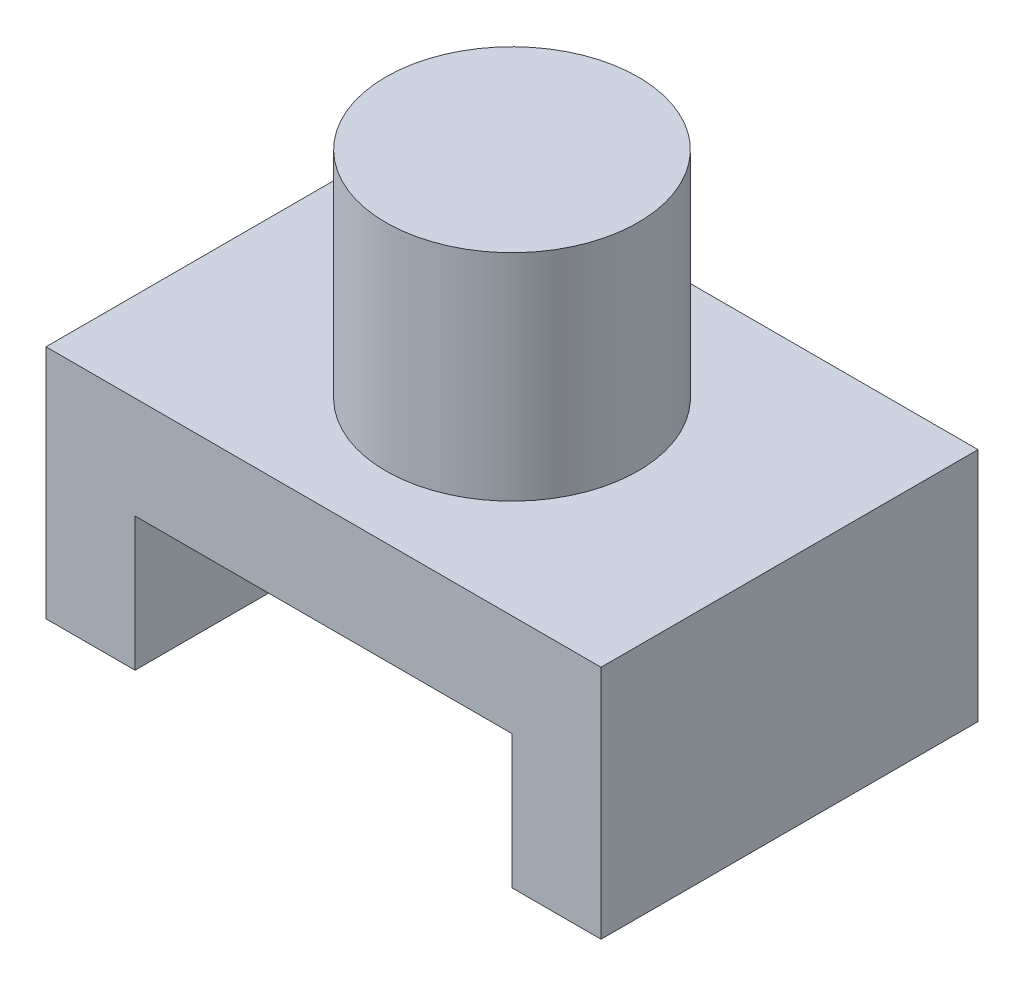
ISO-10303-21;
HEADER;
FILE_DESCRIPTION(('STEP AP214'),'2;1');
FILE_NAME('part.step','',(''),(''),'','','');
FILE_SCHEMA(('AUTOMOTIVE_DESIGN { 1 0 10303 214 1 1 1 1 }'));
ENDSEC;
DATA;
#1=APPLICATION_CONTEXT('core data for automotive mechanical design processes');
#2=APPLICATION_PROTOCOL_DEFINITION('international standard','automotive_design',2000,#1);
#3=PRODUCT_CONTEXT('',#1,'mechanical');
#4=PRODUCT('Part','Part','',(#3));
#5=PRODUCT_RELATED_PRODUCT_CATEGORY('part','',(#4));
#6=PRODUCT_DEFINITION_FORMATION('','',#4);
#7=PRODUCT_DEFINITION_CONTEXT('part definition',#1,'design');
#8=PRODUCT_DEFINITION('design','',#6,#7);
#9=PRODUCT_DEFINITION_SHAPE('','',#8);
#10=(LENGTH_UNIT() NAMED_UNIT(*) SI_UNIT(.MILLI.,.METRE.));
#11=(NAMED_UNIT(*) PLANE_ANGLE_UNIT() SI_UNIT($,.RADIAN.));
#12=(NAMED_UNIT(*) SI_UNIT($,.STERADIAN.) SOLID_ANGLE_UNIT());
#13=UNCERTAINTY_MEASURE_WITH_UNIT(LENGTH_MEASURE(1.E-05),#10,'distance_accuracy_value','');
#14=(GEOMETRIC_REPRESENTATION_CONTEXT(3) GLOBAL_UNCERTAINTY_ASSIGNED_CONTEXT((#13)) GLOBAL_UNIT_ASSIGNED_CONTEXT((#10,
#11,#12)) REPRESENTATION_CONTEXT('',''));
#15=CARTESIAN_POINT('',(0.,0.,0.));
#16=DIRECTION('',(0.,0.,1.));
#17=DIRECTION('',(1.,0.,0.));
#18=AXIS2_PLACEMENT_3D('',#15,#16,#17);
#19=CARTESIAN_POINT('',(-16.1895348837209,0.,25.4));
#20=DIRECTION('',(0.,1.,0.));
#21=DIRECTION('',(0.,0.,1.));
#22=AXIS2_PLACEMENT_3D('',#19,#20,#21);
#23=PLANE('',#22);
#24=DIRECTION('',(1.,0.,0.));
#25=VECTOR('',#24,1.);
#26=CARTESIAN_POINT('',(-16.1895348837209,0.,0.));
#27=LINE('',#26,#25);
#28=CARTESIAN_POINT('',(-16.1895348837209,0.,0.));
#29=VERTEX_POINT('',#28);
#30=CARTESIAN_POINT('',(-10.1895348837209,0.,0.));
#31=VERTEX_POINT('',#30);
#32=EDGE_CURVE('E142',#29,#31,#27,.T.);
#33=ORIENTED_EDGE('',*,*,#32,.T.);
#34=DIRECTION('',(0.,0.,-1.));
#35=VECTOR('',#34,1.);
#36=CARTESIAN_POINT('',(-10.1895348837209,0.,25.4));
#37=LINE('',#36,#35);
#38=CARTESIAN_POINT('',(-10.1895348837209,0.,25.4));
#39=VERTEX_POINT('',#38);
#40=EDGE_CURVE('E42',#39,#31,#37,.T.);
#41=ORIENTED_EDGE('',*,*,#40,.F.);
#42=DIRECTION('',(1.,0.,0.));
#43=VECTOR('',#42,1.);
#44=CARTESIAN_POINT('',(-16.1895348837209,0.,25.4));
#45=LINE('',#44,#43);
#46=CARTESIAN_POINT('',(-16.1895348837209,0.,25.4));
#47=VERTEX_POINT('',#46);
#48=EDGE_CURVE('E165',#47,#39,#45,.T.);
#49=ORIENTED_EDGE('',*,*,#48,.F.);
#50=DIRECTION('',(0.,0.,-1.));
#51=VECTOR('',#50,1.);
#52=CARTESIAN_POINT('',(-16.1895348837209,0.,25.4));
#53=LINE('',#52,#51);
#54=EDGE_CURVE('E138',#47,#29,#53,.T.);
#55=ORIENTED_EDGE('',*,*,#54,.T.);
#56=EDGE_LOOP('',(#33,#41,#49,#55));
#57=FACE_BOUND('',#56,.T.);
#58=ADVANCED_FACE('F39',(#57),#23,.F.);
#59=CARTESIAN_POINT('',(-10.1895348837209,0.,25.4));
#60=DIRECTION('',(-1.,0.,0.));
#61=DIRECTION('',(0.,0.,1.));
#62=AXIS2_PLACEMENT_3D('',#59,#60,#61);
#63=PLANE('',#62);
#64=DIRECTION('',(0.,1.,0.));
#65=VECTOR('',#64,1.);
#66=CARTESIAN_POINT('',(-10.1895348837209,0.,0.));
#67=LINE('',#66,#65);
#68=CARTESIAN_POINT('',(-10.1895348837209,9.,0.));
#69=VERTEX_POINT('',#68);
#70=EDGE_CURVE('E146',#31,#69,#67,.T.);
#71=ORIENTED_EDGE('',*,*,#70,.T.);
#72=DIRECTION('',(0.,0.,-1.));
#73=VECTOR('',#72,1.);
#74=CARTESIAN_POINT('',(-10.1895348837209,9.,25.4));
#75=LINE('',#74,#73);
#76=CARTESIAN_POINT('',(-10.1895348837209,9.,25.4));
#77=VERTEX_POINT('',#76);
#78=EDGE_CURVE('E179',#77,#69,#75,.T.);
#79=ORIENTED_EDGE('',*,*,#78,.F.);
#80=DIRECTION('',(0.,1.,0.));
#81=VECTOR('',#80,1.);
#82=CARTESIAN_POINT('',(-10.1895348837209,0.,25.4));
#83=LINE('',#82,#81);
#84=EDGE_CURVE('E101',#39,#77,#83,.T.);
#85=ORIENTED_EDGE('',*,*,#84,.F.);
#86=ORIENTED_EDGE('',*,*,#40,.T.);
#87=EDGE_LOOP('',(#71,#79,#85,#86));
#88=FACE_BOUND('',#87,.T.);
#89=ADVANCED_FACE('F187',(#88),#63,.F.);
#90=CARTESIAN_POINT('',(-10.1895348837209,9.,25.4));
#91=DIRECTION('',(0.,1.,0.));
#92=DIRECTION('',(0.,0.,1.));
#93=AXIS2_PLACEMENT_3D('',#90,#91,#92);
#94=PLANE('',#93);
#95=DIRECTION('',(1.,0.,0.));
#96=VECTOR('',#95,1.);
#97=CARTESIAN_POINT('',(-10.1895348837209,9.,0.));
#98=LINE('',#97,#96);
#99=CARTESIAN_POINT('',(15.2104651162791,9.,0.));
#100=VERTEX_POINT('',#99);
#101=EDGE_CURVE('E150',#69,#100,#98,.T.);
#102=ORIENTED_EDGE('',*,*,#101,.T.);
#103=DIRECTION('',(0.,0.,-1.));
#104=VECTOR('',#103,1.);
#105=CARTESIAN_POINT('',(15.2104651162791,9.,25.4));
#106=LINE('',#105,#104);
#107=CARTESIAN_POINT('',(15.2104651162791,9.,25.4));
#108=VERTEX_POINT('',#107);
#109=EDGE_CURVE('E176',#108,#100,#106,.T.);
#110=ORIENTED_EDGE('',*,*,#109,.F.);
#111=DIRECTION('',(1.,0.,0.));
#112=VECTOR('',#111,1.);
#113=CARTESIAN_POINT('',(-10.1895348837209,9.,25.4));
#114=LINE('',#113,#112);
#115=EDGE_CURVE('E203',#77,#108,#114,.T.);
#116=ORIENTED_EDGE('',*,*,#115,.F.);
#117=ORIENTED_EDGE('',*,*,#78,.T.);
#118=EDGE_LOOP('',(#102,#110,#116,#117));
#119=FACE_BOUND('',#118,.T.);
#120=ADVANCED_FACE('F196',(#119),#94,.F.);
#121=CARTESIAN_POINT('',(15.2104651162791,9.,25.4));
#122=DIRECTION('',(1.,0.,0.));
#123=DIRECTION('',(0.,1.,0.));
#124=AXIS2_PLACEMENT_3D('',#121,#122,#123);
#125=PLANE('',#124);
#126=DIRECTION('',(0.,-1.,0.));
#127=VECTOR('',#126,1.);
#128=CARTESIAN_POINT('',(15.2104651162791,9.,0.));
#129=LINE('',#128,#127);
#130=CARTESIAN_POINT('',(15.2104651162791,0.,0.));
#131=VERTEX_POINT('',#130);
#132=EDGE_CURVE('E153',#100,#131,#129,.T.);
#133=ORIENTED_EDGE('',*,*,#132,.T.);
#134=DIRECTION('',(0.,0.,-1.));
#135=VECTOR('',#134,1.);
#136=CARTESIAN_POINT('',(15.2104651162791,0.,25.4));
#137=LINE('',#136,#135);
#138=CARTESIAN_POINT('',(15.2104651162791,0.,25.4));
#139=VERTEX_POINT('',#138);
#140=EDGE_CURVE('E172',#139,#131,#137,.T.);
#141=ORIENTED_EDGE('',*,*,#140,.F.);
#142=DIRECTION('',(0.,-1.,0.));
#143=VECTOR('',#142,1.);
#144=CARTESIAN_POINT('',(15.2104651162791,9.,25.4));
#145=LINE('',#144,#143);
#146=EDGE_CURVE('E201',#108,#139,#145,.T.);
#147=ORIENTED_EDGE('',*,*,#146,.F.);
#148=ORIENTED_EDGE('',*,*,#109,.T.);
#149=EDGE_LOOP('',(#133,#141,#147,#148));
#150=FACE_BOUND('',#149,.T.);
#151=ADVANCED_FACE('F199',(#150),#125,.F.);
#152=CARTESIAN_POINT('',(15.2104651162791,0.,25.4));
#153=DIRECTION('',(0.,1.,0.));
#154=DIRECTION('',(0.,0.,1.));
#155=AXIS2_PLACEMENT_3D('',#152,#153,#154);
#156=PLANE('',#155);
#157=DIRECTION('',(1.,0.,0.));
#158=VECTOR('',#157,1.);
#159=CARTESIAN_POINT('',(15.2104651162791,0.,0.));
#160=LINE('',#159,#158);
#161=CARTESIAN_POINT('',(21.2104651162791,0.,0.));
#162=VERTEX_POINT('',#161);
#163=EDGE_CURVE('E156',#131,#162,#160,.T.);
#164=ORIENTED_EDGE('',*,*,#163,.T.);
#165=DIRECTION('',(0.,0.,-1.));
#166=VECTOR('',#165,1.);
#167=CARTESIAN_POINT('',(21.2104651162791,0.,25.4));
#168=LINE('',#167,#166);
#169=CARTESIAN_POINT('',(21.2104651162791,0.,25.4));
#170=VERTEX_POINT('',#169);
#171=EDGE_CURVE('E131',#170,#162,#168,.T.);
#172=ORIENTED_EDGE('',*,*,#171,.F.);
#173=DIRECTION('',(1.,0.,0.));
#174=VECTOR('',#173,1.);
#175=CARTESIAN_POINT('',(15.2104651162791,0.,25.4));
#176=LINE('',#175,#174);
#177=EDGE_CURVE('E120',#139,#170,#176,.T.);
#178=ORIENTED_EDGE('',*,*,#177,.F.);
#179=ORIENTED_EDGE('',*,*,#140,.T.);
#180=EDGE_LOOP('',(#164,#172,#178,#179));
#181=FACE_BOUND('',#180,.T.);
#182=ADVANCED_FACE('F235',(#181),#156,.F.);
#183=CARTESIAN_POINT('',(21.2104651162791,0.,25.4));
#184=DIRECTION('',(-1.,0.,0.));
#185=DIRECTION('',(0.,0.,1.));
#186=AXIS2_PLACEMENT_3D('',#183,#184,#185);
#187=PLANE('',#186);
#188=DIRECTION('',(0.,1.,0.));
#189=VECTOR('',#188,1.);
#190=CARTESIAN_POINT('',(21.2104651162791,0.,0.));
#191=LINE('',#190,#189);
#192=CARTESIAN_POINT('',(21.2104651162791,15.875,0.));
#193=VERTEX_POINT('',#192);
#194=EDGE_CURVE('E129',#162,#193,#191,.T.);
#195=ORIENTED_EDGE('',*,*,#194,.T.);
#196=DIRECTION('',(0.,0.,-1.));
#197=VECTOR('',#196,1.);
#198=CARTESIAN_POINT('',(21.2104651162791,15.875,25.4));
#199=LINE('',#198,#197);
#200=CARTESIAN_POINT('',(21.2104651162791,15.875,25.4));
#201=VERTEX_POINT('',#200);
#202=EDGE_CURVE('E126',#201,#193,#199,.T.);
#203=ORIENTED_EDGE('',*,*,#202,.F.);
#204=DIRECTION('',(0.,1.,0.));
#205=VECTOR('',#204,1.);
#206=CARTESIAN_POINT('',(21.2104651162791,0.,25.4));
#207=LINE('',#206,#205);
#208=EDGE_CURVE('E114',#170,#201,#207,.T.);
#209=ORIENTED_EDGE('',*,*,#208,.F.);
#210=ORIENTED_EDGE('',*,*,#171,.T.);
#211=EDGE_LOOP('',(#195,#203,#209,#210));
#212=FACE_BOUND('',#211,.T.);
#213=ADVANCED_FACE('F127',(#212),#187,.F.);
#214=CARTESIAN_POINT('',(21.2104651162791,15.875,25.4));
#215=DIRECTION('',(0.,-1.,0.));
#216=DIRECTION('',(1.,0.,0.));
#217=AXIS2_PLACEMENT_3D('',#214,#215,#216);
#218=PLANE('',#217);
#219=CARTESIAN_POINT('',(2.51046511627907,15.875,12.7));
#220=DIRECTION('',(0.,1.,0.));
#221=DIRECTION('',(-1.,0.,0.));
#222=AXIS2_PLACEMENT_3D('',#219,#220,#221);
#223=CIRCLE('',#222,8.5);
#224=CARTESIAN_POINT('',(-5.98953488372093,15.875,12.7));
#225=VERTEX_POINT('',#224);
#226=EDGE_CURVE('E11',#225,#225,#223,.T.);
#227=ORIENTED_EDGE('',*,*,#226,.F.);
#228=EDGE_LOOP('',(#227));
#229=FACE_BOUND('',#228,.T.);
#230=DIRECTION('',(-1.,0.,0.));
#231=VECTOR('',#230,1.);
#232=CARTESIAN_POINT('',(21.2104651162791,15.875,0.));
#233=LINE('',#232,#231);
#234=CARTESIAN_POINT('',(-16.1895348837209,15.875,0.));
#235=VERTEX_POINT('',#234);
#236=EDGE_CURVE('E86',#193,#235,#233,.T.);
#237=ORIENTED_EDGE('',*,*,#236,.T.);
#238=DIRECTION('',(0.,0.,-1.));
#239=VECTOR('',#238,1.);
#240=CARTESIAN_POINT('',(-16.1895348837209,15.875,25.4));
#241=LINE('',#240,#239);
#242=CARTESIAN_POINT('',(-16.1895348837209,15.875,25.4));
#243=VERTEX_POINT('',#242);
#244=EDGE_CURVE('E132',#243,#235,#241,.T.);
#245=ORIENTED_EDGE('',*,*,#244,.F.);
#246=DIRECTION('',(-1.,0.,0.));
#247=VECTOR('',#246,1.);
#248=CARTESIAN_POINT('',(21.2104651162791,15.875,25.4));
#249=LINE('',#248,#247);
#250=EDGE_CURVE('E118',#201,#243,#249,.T.);
#251=ORIENTED_EDGE('',*,*,#250,.F.);
#252=ORIENTED_EDGE('',*,*,#202,.T.);
#253=EDGE_LOOP('',(#237,#245,#251,#252));
#254=FACE_BOUND('',#253,.T.);
#255=ADVANCED_FACE('F134',(#229,#254),#218,.F.);
#256=CARTESIAN_POINT('',(-16.1895348837209,15.875,25.4));
#257=DIRECTION('',(1.,0.,0.));
#258=DIRECTION('',(0.,1.,0.));
#259=AXIS2_PLACEMENT_3D('',#256,#257,#258);
#260=PLANE('',#259);
#261=DIRECTION('',(0.,-1.,0.));
#262=VECTOR('',#261,1.);
#263=CARTESIAN_POINT('',(-16.1895348837209,15.875,0.));
#264=LINE('',#263,#262);
#265=EDGE_CURVE('E92',#235,#29,#264,.T.);
#266=ORIENTED_EDGE('',*,*,#265,.T.);
#267=ORIENTED_EDGE('',*,*,#54,.F.);
#268=DIRECTION('',(0.,-1.,0.));
#269=VECTOR('',#268,1.);
#270=CARTESIAN_POINT('',(-16.1895348837209,15.875,25.4));
#271=LINE('',#270,#269);
#272=EDGE_CURVE('E57',#243,#47,#271,.T.);
#273=ORIENTED_EDGE('',*,*,#272,.F.);
#274=ORIENTED_EDGE('',*,*,#244,.T.);
#275=EDGE_LOOP('',(#266,#267,#273,#274));
#276=FACE_BOUND('',#275,.T.);
#277=ADVANCED_FACE('F226',(#276),#260,.F.);
#278=CARTESIAN_POINT('',(0.,0.,25.4));
#279=DIRECTION('',(0.,0.,1.));
#280=DIRECTION('',(1.,0.,0.));
#281=AXIS2_PLACEMENT_3D('',#278,#279,#280);
#282=PLANE('',#281);
#283=ORIENTED_EDGE('',*,*,#48,.T.);
#284=ORIENTED_EDGE('',*,*,#84,.T.);
#285=ORIENTED_EDGE('',*,*,#115,.T.);
#286=ORIENTED_EDGE('',*,*,#146,.T.);
#287=ORIENTED_EDGE('',*,*,#177,.T.);
#288=ORIENTED_EDGE('',*,*,#208,.T.);
#289=ORIENTED_EDGE('',*,*,#250,.T.);
#290=ORIENTED_EDGE('',*,*,#272,.T.);
#291=EDGE_LOOP('',(#283,#284,#285,#286,#287,#288,#289,#290));
#292=FACE_BOUND('',#291,.T.);
#293=ADVANCED_FACE('F116',(#292),#282,.T.);
#294=CARTESIAN_POINT('',(0.,0.,0.));
#295=DIRECTION('',(0.,0.,1.));
#296=DIRECTION('',(1.,0.,0.));
#297=AXIS2_PLACEMENT_3D('',#294,#295,#296);
#298=PLANE('',#297);
#299=ORIENTED_EDGE('',*,*,#32,.F.);
#300=ORIENTED_EDGE('',*,*,#265,.F.);
#301=ORIENTED_EDGE('',*,*,#236,.F.);
#302=ORIENTED_EDGE('',*,*,#194,.F.);
#303=ORIENTED_EDGE('',*,*,#163,.F.);
#304=ORIENTED_EDGE('',*,*,#132,.F.);
#305=ORIENTED_EDGE('',*,*,#101,.F.);
#306=ORIENTED_EDGE('',*,*,#70,.F.);
#307=EDGE_LOOP('',(#299,#300,#301,#302,#303,#304,#305,#306));
#308=FACE_BOUND('',#307,.T.);
#309=ADVANCED_FACE('F192',(#308),#298,.F.);
#310=CARTESIAN_POINT('',(2.51046511627907,30.375,12.7));
#311=DIRECTION('',(0.,-1.,0.));
#312=DIRECTION('',(1.,0.,0.));
#313=AXIS2_PLACEMENT_3D('',#310,#311,#312);
#314=CYLINDRICAL_SURFACE('',#313,8.5);
#315=CARTESIAN_POINT('',(2.51046511627907,30.375,12.7));
#316=DIRECTION('',(0.,1.,0.));
#317=DIRECTION('',(-1.,0.,0.));
#318=AXIS2_PLACEMENT_3D('',#315,#316,#317);
#319=CIRCLE('',#318,8.5);
#320=CARTESIAN_POINT('',(-5.98953488372093,30.375,12.7));
#321=VERTEX_POINT('',#320);
#322=EDGE_CURVE('E147',#321,#321,#319,.T.);
#323=ORIENTED_EDGE('',*,*,#322,.F.);
#324=EDGE_LOOP('',(#323));
#325=FACE_BOUND('',#324,.T.);
#326=ORIENTED_EDGE('',*,*,#226,.T.);
#327=EDGE_LOOP('',(#326));
#328=FACE_BOUND('',#327,.T.);
#329=ADVANCED_FACE('F219',(#325,#328),#314,.T.);
#330=CARTESIAN_POINT('',(2.51046511627907,30.375,12.7));
#331=DIRECTION('',(0.,1.,0.));
#332=DIRECTION('',(-1.,0.,0.));
#333=AXIS2_PLACEMENT_3D('',#330,#331,#332);
#334=PLANE('',#333);
#335=ORIENTED_EDGE('',*,*,#322,.T.);
#336=EDGE_LOOP('',(#335));
#337=FACE_BOUND('',#336,.T.);
#338=ADVANCED_FACE('F217',(#337),#334,.T.);
#339=CLOSED_SHELL('',(#58,#89,#120,#151,#182,#213,#255,#277,#293,#309,#329,#338));
#340=MANIFOLD_SOLID_BREP('B2',#339);
#341=ADVANCED_BREP_SHAPE_REPRESENTATION('',(#18,#340),#14);
#342=SHAPE_DEFINITION_REPRESENTATION(#9,#341);
ENDSEC;
END-ISO-10303-21;
